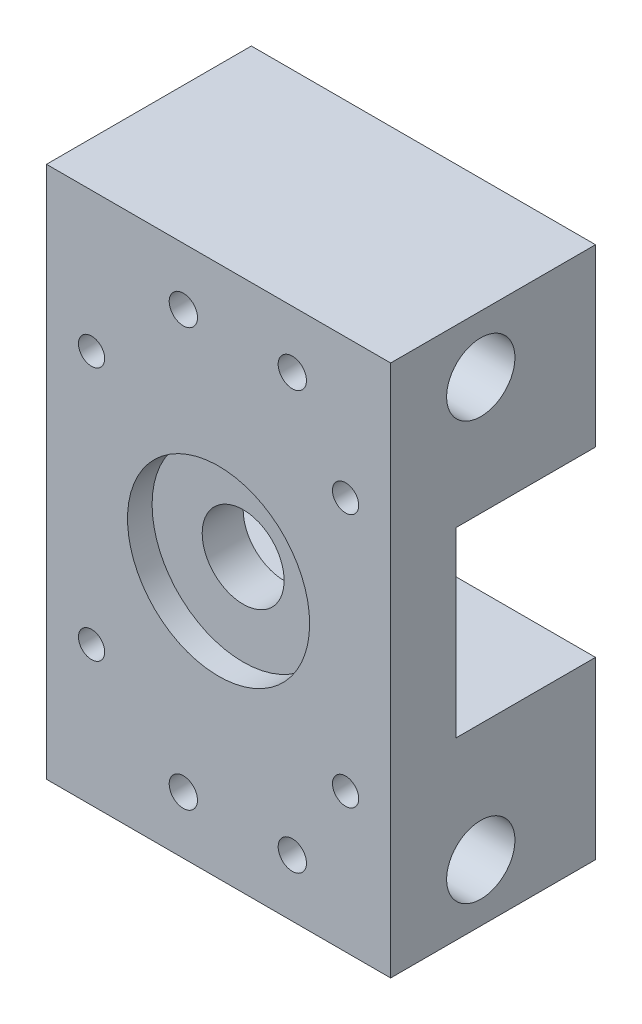
ISO-10303-21;
HEADER;
FILE_DESCRIPTION(('STEP AP214'),'2;1');
FILE_NAME('part.step','',(''),(''),'','','');
FILE_SCHEMA(('AUTOMOTIVE_DESIGN { 1 0 10303 214 1 1 1 1 }'));
ENDSEC;
DATA;
#1=APPLICATION_CONTEXT('core data for automotive mechanical design processes');
#2=APPLICATION_PROTOCOL_DEFINITION('international standard','automotive_design',2000,#1);
#3=PRODUCT_CONTEXT('',#1,'mechanical');
#4=PRODUCT('Part','Part','',(#3));
#5=PRODUCT_RELATED_PRODUCT_CATEGORY('part','',(#4));
#6=PRODUCT_DEFINITION_FORMATION('','',#4);
#7=PRODUCT_DEFINITION_CONTEXT('part definition',#1,'design');
#8=PRODUCT_DEFINITION('design','',#6,#7);
#9=PRODUCT_DEFINITION_SHAPE('','',#8);
#10=(LENGTH_UNIT() NAMED_UNIT(*) SI_UNIT(.MILLI.,.METRE.));
#11=(NAMED_UNIT(*) PLANE_ANGLE_UNIT() SI_UNIT($,.RADIAN.));
#12=(NAMED_UNIT(*) SI_UNIT($,.STERADIAN.) SOLID_ANGLE_UNIT());
#13=UNCERTAINTY_MEASURE_WITH_UNIT(LENGTH_MEASURE(1.E-05),#10,'distance_accuracy_value','');
#14=(GEOMETRIC_REPRESENTATION_CONTEXT(3) GLOBAL_UNCERTAINTY_ASSIGNED_CONTEXT((#13)) GLOBAL_UNIT_ASSIGNED_CONTEXT((#10,
#11,#12)) REPRESENTATION_CONTEXT('',''));
#15=CARTESIAN_POINT('',(0.,0.,0.));
#16=DIRECTION('',(0.,0.,1.));
#17=DIRECTION('',(1.,0.,0.));
#18=AXIS2_PLACEMENT_3D('',#15,#16,#17);
#19=CARTESIAN_POINT('',(21.,32.5,21.));
#20=DIRECTION('',(0.,0.,1.));
#21=DIRECTION('',(1.,0.,0.));
#22=AXIS2_PLACEMENT_3D('',#19,#20,#21);
#23=CYLINDRICAL_SURFACE('',#22,11.1125);
#24=CARTESIAN_POINT('',(21.,32.5,25.));
#25=DIRECTION('',(0.,0.,1.));
#26=DIRECTION('',(1.,0.,0.));
#27=AXIS2_PLACEMENT_3D('',#24,#25,#26);
#28=CIRCLE('',#27,11.1125);
#29=CARTESIAN_POINT('',(32.1125,32.5,25.));
#30=VERTEX_POINT('',#29);
#31=EDGE_CURVE('E128',#30,#30,#28,.T.);
#32=ORIENTED_EDGE('',*,*,#31,.T.);
#33=EDGE_LOOP('',(#32));
#34=FACE_BOUND('',#33,.T.);
#35=CARTESIAN_POINT('',(21.,32.5,22.));
#36=DIRECTION('',(0.,0.,-1.));
#37=DIRECTION('',(-1.,0.,0.));
#38=AXIS2_PLACEMENT_3D('',#35,#36,#37);
#39=CIRCLE('',#38,11.1125);
#40=CARTESIAN_POINT('',(9.88750000000001,32.5,22.));
#41=VERTEX_POINT('',#40);
#42=EDGE_CURVE('E11',#41,#41,#39,.F.);
#43=ORIENTED_EDGE('',*,*,#42,.F.);
#44=EDGE_LOOP('',(#43));
#45=FACE_BOUND('',#44,.T.);
#46=ADVANCED_FACE('F35',(#34,#45),#23,.F.);
#47=CARTESIAN_POINT('',(0.,0.,0.));
#48=DIRECTION('',(0.,0.,1.));
#49=DIRECTION('',(1.,0.,0.));
#50=AXIS2_PLACEMENT_3D('',#47,#48,#49);
#51=PLANE('',#50);
#52=CARTESIAN_POINT('',(36.5,17.,0.));
#53=DIRECTION('',(0.,0.,-1.));
#54=DIRECTION('',(-1.,0.,0.));
#55=AXIS2_PLACEMENT_3D('',#52,#53,#54);
#56=CIRCLE('',#55,3.);
#57=CARTESIAN_POINT('',(33.5,17.,0.));
#58=VERTEX_POINT('',#57);
#59=EDGE_CURVE('E149',#58,#58,#56,.T.);
#60=ORIENTED_EDGE('',*,*,#59,.F.);
#61=EDGE_LOOP('',(#60));
#62=FACE_BOUND('',#61,.T.);
#63=CARTESIAN_POINT('',(30.,7.,0.));
#64=DIRECTION('',(0.,0.,-1.));
#65=DIRECTION('',(-1.,0.,0.));
#66=AXIS2_PLACEMENT_3D('',#63,#64,#65);
#67=CIRCLE('',#66,1.72719999999998);
#68=CARTESIAN_POINT('',(28.2728,7.,0.));
#69=VERTEX_POINT('',#68);
#70=EDGE_CURVE('E185',#69,#69,#67,.T.);
#71=ORIENTED_EDGE('',*,*,#70,.F.);
#72=EDGE_LOOP('',(#71));
#73=FACE_BOUND('',#72,.T.);
#74=CARTESIAN_POINT('',(16.7,7.,0.));
#75=DIRECTION('',(0.,0.,-1.));
#76=DIRECTION('',(-1.,0.,0.));
#77=AXIS2_PLACEMENT_3D('',#74,#75,#76);
#78=CIRCLE('',#77,1.72719999999998);
#79=CARTESIAN_POINT('',(14.9728,7.,0.));
#80=VERTEX_POINT('',#79);
#81=EDGE_CURVE('E188',#80,#80,#78,.T.);
#82=ORIENTED_EDGE('',*,*,#81,.F.);
#83=EDGE_LOOP('',(#82));
#84=FACE_BOUND('',#83,.T.);
#85=DIRECTION('',(0.,-1.,0.));
#86=VECTOR('',#85,1.);
#87=CARTESIAN_POINT('',(0.,65.,0.));
#88=LINE('',#87,#86);
#89=CARTESIAN_POINT('',(0.,21.3875,0.));
#90=VERTEX_POINT('',#89);
#91=CARTESIAN_POINT('',(0.,0.,0.));
#92=VERTEX_POINT('',#91);
#93=EDGE_CURVE('E108',#90,#92,#88,.T.);
#94=ORIENTED_EDGE('',*,*,#93,.F.);
#95=DIRECTION('',(1.,0.,0.));
#96=VECTOR('',#95,1.);
#97=CARTESIAN_POINT('',(0.,21.3875,0.));
#98=LINE('',#97,#96);
#99=CARTESIAN_POINT('',(42.,21.3875,0.));
#100=VERTEX_POINT('',#99);
#101=EDGE_CURVE('E205',#90,#100,#98,.T.);
#102=ORIENTED_EDGE('',*,*,#101,.T.);
#103=DIRECTION('',(0.,1.,0.));
#104=VECTOR('',#103,1.);
#105=CARTESIAN_POINT('',(42.,0.,0.));
#106=LINE('',#105,#104);
#107=CARTESIAN_POINT('',(42.,0.,0.));
#108=VERTEX_POINT('',#107);
#109=EDGE_CURVE('E228',#108,#100,#106,.T.);
#110=ORIENTED_EDGE('',*,*,#109,.F.);
#111=DIRECTION('',(1.,0.,0.));
#112=VECTOR('',#111,1.);
#113=CARTESIAN_POINT('',(0.,0.,0.));
#114=LINE('',#113,#112);
#115=EDGE_CURVE('E226',#92,#108,#114,.T.);
#116=ORIENTED_EDGE('',*,*,#115,.F.);
#117=EDGE_LOOP('',(#94,#102,#110,#116));
#118=FACE_BOUND('',#117,.T.);
#119=CARTESIAN_POINT('',(5.5,17.,0.));
#120=DIRECTION('',(0.,0.,-1.));
#121=DIRECTION('',(-1.,0.,0.));
#122=AXIS2_PLACEMENT_3D('',#119,#120,#121);
#123=CIRCLE('',#122,3.);
#124=CARTESIAN_POINT('',(2.5,17.,0.));
#125=VERTEX_POINT('',#124);
#126=EDGE_CURVE('E158',#125,#125,#123,.T.);
#127=ORIENTED_EDGE('',*,*,#126,.F.);
#128=EDGE_LOOP('',(#127));
#129=FACE_BOUND('',#128,.T.);
#130=ADVANCED_FACE('F248',(#62,#73,#84,#118,#129),#51,.F.);
#131=CARTESIAN_POINT('',(42.,65.,0.));
#132=DIRECTION('',(0.,1.,0.));
#133=DIRECTION('',(0.,0.,1.));
#134=AXIS2_PLACEMENT_3D('',#131,#132,#133);
#135=PLANE('',#134);
#136=DIRECTION('',(0.,0.,1.));
#137=VECTOR('',#136,1.);
#138=CARTESIAN_POINT('',(0.,65.,0.));
#139=LINE('',#138,#137);
#140=CARTESIAN_POINT('',(0.,65.,0.));
#141=VERTEX_POINT('',#140);
#142=CARTESIAN_POINT('',(0.,65.,25.));
#143=VERTEX_POINT('',#142);
#144=EDGE_CURVE('E113',#141,#143,#139,.T.);
#145=ORIENTED_EDGE('',*,*,#144,.T.);
#146=DIRECTION('',(-1.,0.,0.));
#147=VECTOR('',#146,1.);
#148=CARTESIAN_POINT('',(0.,65.,25.));
#149=LINE('',#148,#147);
#150=CARTESIAN_POINT('',(42.,65.,25.));
#151=VERTEX_POINT('',#150);
#152=EDGE_CURVE('E127',#151,#143,#149,.T.);
#153=ORIENTED_EDGE('',*,*,#152,.F.);
#154=DIRECTION('',(0.,0.,1.));
#155=VECTOR('',#154,1.);
#156=CARTESIAN_POINT('',(42.,65.,0.));
#157=LINE('',#156,#155);
#158=CARTESIAN_POINT('',(42.,65.,0.));
#159=VERTEX_POINT('',#158);
#160=EDGE_CURVE('E43',#159,#151,#157,.T.);
#161=ORIENTED_EDGE('',*,*,#160,.F.);
#162=DIRECTION('',(-1.,0.,0.));
#163=VECTOR('',#162,1.);
#164=CARTESIAN_POINT('',(42.,65.,0.));
#165=LINE('',#164,#163);
#166=EDGE_CURVE('E215',#159,#141,#165,.T.);
#167=ORIENTED_EDGE('',*,*,#166,.T.);
#168=EDGE_LOOP('',(#145,#153,#161,#167));
#169=FACE_BOUND('',#168,.T.);
#170=ADVANCED_FACE('F37',(#169),#135,.T.);
#171=CARTESIAN_POINT('',(42.,0.,0.));
#172=DIRECTION('',(1.,0.,0.));
#173=DIRECTION('',(0.,0.,-1.));
#174=AXIS2_PLACEMENT_3D('',#171,#172,#173);
#175=PLANE('',#174);
#176=CARTESIAN_POINT('',(42.,7.,14.));
#177=DIRECTION('',(1.,0.,0.));
#178=DIRECTION('',(0.,0.,-1.));
#179=AXIS2_PLACEMENT_3D('',#176,#177,#178);
#180=CIRCLE('',#179,4.16718750000001);
#181=CARTESIAN_POINT('',(42.,7.,9.83281249999999));
#182=VERTEX_POINT('',#181);
#183=EDGE_CURVE('E137',#182,#182,#180,.T.);
#184=ORIENTED_EDGE('',*,*,#183,.F.);
#185=EDGE_LOOP('',(#184));
#186=FACE_BOUND('',#185,.T.);
#187=CARTESIAN_POINT('',(42.,58.,14.));
#188=DIRECTION('',(1.,0.,0.));
#189=DIRECTION('',(0.,0.,-1.));
#190=AXIS2_PLACEMENT_3D('',#187,#188,#189);
#191=CIRCLE('',#190,4.16718750000002);
#192=CARTESIAN_POINT('',(42.,58.,9.83281249999998));
#193=VERTEX_POINT('',#192);
#194=EDGE_CURVE('E143',#193,#193,#191,.T.);
#195=ORIENTED_EDGE('',*,*,#194,.F.);
#196=EDGE_LOOP('',(#195));
#197=FACE_BOUND('',#196,.T.);
#198=DIRECTION('',(0.,0.,-1.));
#199=VECTOR('',#198,1.);
#200=CARTESIAN_POINT('',(42.,21.3875,17.));
#201=LINE('',#200,#199);
#202=CARTESIAN_POINT('',(42.,21.3875,17.));
#203=VERTEX_POINT('',#202);
#204=EDGE_CURVE('E197',#203,#100,#201,.T.);
#205=ORIENTED_EDGE('',*,*,#204,.F.);
#206=DIRECTION('',(0.,-1.,0.));
#207=VECTOR('',#206,1.);
#208=CARTESIAN_POINT('',(42.,43.6125,17.));
#209=LINE('',#208,#207);
#210=CARTESIAN_POINT('',(42.,43.6125,17.));
#211=VERTEX_POINT('',#210);
#212=EDGE_CURVE('E200',#211,#203,#209,.T.);
#213=ORIENTED_EDGE('',*,*,#212,.F.);
#214=DIRECTION('',(0.,0.,1.));
#215=VECTOR('',#214,1.);
#216=CARTESIAN_POINT('',(42.,43.6125,0.));
#217=LINE('',#216,#215);
#218=CARTESIAN_POINT('',(42.,43.6125,0.));
#219=VERTEX_POINT('',#218);
#220=EDGE_CURVE('E208',#219,#211,#217,.T.);
#221=ORIENTED_EDGE('',*,*,#220,.F.);
#222=EDGE_CURVE('E58',#219,#159,#106,.T.);
#223=ORIENTED_EDGE('',*,*,#222,.T.);
#224=ORIENTED_EDGE('',*,*,#160,.T.);
#225=DIRECTION('',(0.,1.,0.));
#226=VECTOR('',#225,1.);
#227=CARTESIAN_POINT('',(42.,65.,25.));
#228=LINE('',#227,#226);
#229=CARTESIAN_POINT('',(42.,0.,25.));
#230=VERTEX_POINT('',#229);
#231=EDGE_CURVE('E121',#230,#151,#228,.T.);
#232=ORIENTED_EDGE('',*,*,#231,.F.);
#233=DIRECTION('',(0.,0.,1.));
#234=VECTOR('',#233,1.);
#235=CARTESIAN_POINT('',(42.,0.,0.));
#236=LINE('',#235,#234);
#237=EDGE_CURVE('E112',#108,#230,#236,.T.);
#238=ORIENTED_EDGE('',*,*,#237,.F.);
#239=ORIENTED_EDGE('',*,*,#109,.T.);
#240=EDGE_LOOP('',(#205,#213,#221,#223,#224,#232,#238,#239));
#241=FACE_BOUND('',#240,.T.);
#242=ADVANCED_FACE('F240',(#186,#197,#241),#175,.T.);
#243=CARTESIAN_POINT('',(0.,0.,0.));
#244=DIRECTION('',(0.,-1.,0.));
#245=DIRECTION('',(0.,0.,-1.));
#246=AXIS2_PLACEMENT_3D('',#243,#244,#245);
#247=PLANE('',#246);
#248=ORIENTED_EDGE('',*,*,#237,.T.);
#249=DIRECTION('',(1.,0.,0.));
#250=VECTOR('',#249,1.);
#251=CARTESIAN_POINT('',(0.,0.,25.));
#252=LINE('',#251,#250);
#253=CARTESIAN_POINT('',(0.,0.,25.));
#254=VERTEX_POINT('',#253);
#255=EDGE_CURVE('E116',#254,#230,#252,.T.);
#256=ORIENTED_EDGE('',*,*,#255,.F.);
#257=DIRECTION('',(0.,0.,1.));
#258=VECTOR('',#257,1.);
#259=CARTESIAN_POINT('',(0.,0.,0.));
#260=LINE('',#259,#258);
#261=EDGE_CURVE('E101',#92,#254,#260,.T.);
#262=ORIENTED_EDGE('',*,*,#261,.F.);
#263=ORIENTED_EDGE('',*,*,#115,.T.);
#264=EDGE_LOOP('',(#248,#256,#262,#263));
#265=FACE_BOUND('',#264,.T.);
#266=ADVANCED_FACE('F117',(#265),#247,.T.);
#267=CARTESIAN_POINT('',(0.,65.,0.));
#268=DIRECTION('',(-1.,0.,0.));
#269=DIRECTION('',(0.,-1.,0.));
#270=AXIS2_PLACEMENT_3D('',#267,#268,#269);
#271=PLANE('',#270);
#272=DIRECTION('',(0.,0.,-1.));
#273=VECTOR('',#272,1.);
#274=CARTESIAN_POINT('',(0.,21.3875,17.));
#275=LINE('',#274,#273);
#276=CARTESIAN_POINT('',(0.,21.3875,17.));
#277=VERTEX_POINT('',#276);
#278=EDGE_CURVE('E198',#277,#90,#275,.T.);
#279=ORIENTED_EDGE('',*,*,#278,.T.);
#280=ORIENTED_EDGE('',*,*,#93,.T.);
#281=ORIENTED_EDGE('',*,*,#261,.T.);
#282=DIRECTION('',(0.,-1.,0.));
#283=VECTOR('',#282,1.);
#284=CARTESIAN_POINT('',(0.,65.,25.));
#285=LINE('',#284,#283);
#286=EDGE_CURVE('E106',#143,#254,#285,.T.);
#287=ORIENTED_EDGE('',*,*,#286,.F.);
#288=ORIENTED_EDGE('',*,*,#144,.F.);
#289=CARTESIAN_POINT('',(0.,43.6125,0.));
#290=VERTEX_POINT('',#289);
#291=EDGE_CURVE('E223',#141,#290,#88,.T.);
#292=ORIENTED_EDGE('',*,*,#291,.T.);
#293=DIRECTION('',(0.,0.,1.));
#294=VECTOR('',#293,1.);
#295=CARTESIAN_POINT('',(0.,43.6125,0.));
#296=LINE('',#295,#294);
#297=CARTESIAN_POINT('',(0.,43.6125,17.));
#298=VERTEX_POINT('',#297);
#299=EDGE_CURVE('E50',#290,#298,#296,.T.);
#300=ORIENTED_EDGE('',*,*,#299,.T.);
#301=DIRECTION('',(0.,-1.,0.));
#302=VECTOR('',#301,1.);
#303=CARTESIAN_POINT('',(0.,43.6125,17.));
#304=LINE('',#303,#302);
#305=EDGE_CURVE('E202',#298,#277,#304,.T.);
#306=ORIENTED_EDGE('',*,*,#305,.T.);
#307=EDGE_LOOP('',(#279,#280,#281,#287,#288,#292,#300,#306));
#308=FACE_BOUND('',#307,.T.);
#309=ADVANCED_FACE('F104',(#308),#271,.T.);
#310=CARTESIAN_POINT('',(5.5,48.,0.));
#311=DIRECTION('',(0.,0.,-1.));
#312=DIRECTION('',(-1.,0.,0.));
#313=AXIS2_PLACEMENT_3D('',#310,#311,#312);
#314=CIRCLE('',#313,3.);
#315=CARTESIAN_POINT('',(2.5,48.,0.));
#316=VERTEX_POINT('',#315);
#317=EDGE_CURVE('E167',#316,#316,#314,.T.);
#318=ORIENTED_EDGE('',*,*,#317,.F.);
#319=EDGE_LOOP('',(#318));
#320=FACE_BOUND('',#319,.T.);
#321=CARTESIAN_POINT('',(36.5,48.,0.));
#322=DIRECTION('',(0.,0.,-1.));
#323=DIRECTION('',(-1.,0.,0.));
#324=AXIS2_PLACEMENT_3D('',#321,#322,#323);
#325=CIRCLE('',#324,3.);
#326=CARTESIAN_POINT('',(33.5,48.,0.));
#327=VERTEX_POINT('',#326);
#328=EDGE_CURVE('E176',#327,#327,#325,.T.);
#329=ORIENTED_EDGE('',*,*,#328,.F.);
#330=EDGE_LOOP('',(#329));
#331=FACE_BOUND('',#330,.T.);
#332=CARTESIAN_POINT('',(16.7,58.,0.));
#333=DIRECTION('',(0.,0.,-1.));
#334=DIRECTION('',(-1.,0.,0.));
#335=AXIS2_PLACEMENT_3D('',#332,#333,#334);
#336=CIRCLE('',#335,1.72719999999998);
#337=CARTESIAN_POINT('',(14.9728,58.,0.));
#338=VERTEX_POINT('',#337);
#339=EDGE_CURVE('E191',#338,#338,#336,.T.);
#340=ORIENTED_EDGE('',*,*,#339,.F.);
#341=EDGE_LOOP('',(#340));
#342=FACE_BOUND('',#341,.T.);
#343=CARTESIAN_POINT('',(30.,58.,0.));
#344=DIRECTION('',(0.,0.,-1.));
#345=DIRECTION('',(-1.,0.,0.));
#346=AXIS2_PLACEMENT_3D('',#343,#344,#345);
#347=CIRCLE('',#346,1.72719999999998);
#348=CARTESIAN_POINT('',(28.2728,58.,0.));
#349=VERTEX_POINT('',#348);
#350=EDGE_CURVE('E194',#349,#349,#347,.T.);
#351=ORIENTED_EDGE('',*,*,#350,.F.);
#352=EDGE_LOOP('',(#351));
#353=FACE_BOUND('',#352,.T.);
#354=ORIENTED_EDGE('',*,*,#222,.F.);
#355=DIRECTION('',(1.,0.,0.));
#356=VECTOR('',#355,1.);
#357=CARTESIAN_POINT('',(0.,43.6125,0.));
#358=LINE('',#357,#356);
#359=EDGE_CURVE('E218',#290,#219,#358,.T.);
#360=ORIENTED_EDGE('',*,*,#359,.F.);
#361=ORIENTED_EDGE('',*,*,#291,.F.);
#362=ORIENTED_EDGE('',*,*,#166,.F.);
#363=EDGE_LOOP('',(#354,#360,#361,#362));
#364=FACE_BOUND('',#363,.T.);
#365=ADVANCED_FACE('F236',(#320,#331,#342,#353,#364),#51,.F.);
#366=CARTESIAN_POINT('',(0.,21.3875,17.));
#367=DIRECTION('',(0.,-1.,0.));
#368=DIRECTION('',(0.,0.,-1.));
#369=AXIS2_PLACEMENT_3D('',#366,#367,#368);
#370=PLANE('',#369);
#371=ORIENTED_EDGE('',*,*,#204,.T.);
#372=ORIENTED_EDGE('',*,*,#101,.F.);
#373=ORIENTED_EDGE('',*,*,#278,.F.);
#374=DIRECTION('',(1.,0.,0.));
#375=VECTOR('',#374,1.);
#376=CARTESIAN_POINT('',(0.,21.3875,17.));
#377=LINE('',#376,#375);
#378=EDGE_CURVE('E213',#277,#203,#377,.T.);
#379=ORIENTED_EDGE('',*,*,#378,.T.);
#380=EDGE_LOOP('',(#371,#372,#373,#379));
#381=FACE_BOUND('',#380,.T.);
#382=ADVANCED_FACE('F251',(#381),#370,.F.);
#383=CARTESIAN_POINT('',(0.,43.6125,17.));
#384=DIRECTION('',(0.,0.,1.));
#385=DIRECTION('',(1.,0.,0.));
#386=AXIS2_PLACEMENT_3D('',#383,#384,#385);
#387=PLANE('',#386);
#388=ORIENTED_EDGE('',*,*,#212,.T.);
#389=ORIENTED_EDGE('',*,*,#378,.F.);
#390=ORIENTED_EDGE('',*,*,#305,.F.);
#391=DIRECTION('',(1.,0.,0.));
#392=VECTOR('',#391,1.);
#393=CARTESIAN_POINT('',(0.,43.6125,17.));
#394=LINE('',#393,#392);
#395=EDGE_CURVE('E216',#298,#211,#394,.T.);
#396=ORIENTED_EDGE('',*,*,#395,.T.);
#397=EDGE_LOOP('',(#388,#389,#390,#396));
#398=FACE_BOUND('',#397,.T.);
#399=CARTESIAN_POINT('',(21.,32.5,17.));
#400=DIRECTION('',(0.,0.,-1.));
#401=DIRECTION('',(-1.,0.,0.));
#402=AXIS2_PLACEMENT_3D('',#399,#400,#401);
#403=CIRCLE('',#402,5.);
#404=CARTESIAN_POINT('',(16.,32.5,17.));
#405=VERTEX_POINT('',#404);
#406=EDGE_CURVE('E616',#405,#405,#403,.T.);
#407=ORIENTED_EDGE('',*,*,#406,.F.);
#408=EDGE_LOOP('',(#407));
#409=FACE_BOUND('',#408,.T.);
#410=ADVANCED_FACE('F242',(#398,#409),#387,.F.);
#411=CARTESIAN_POINT('',(0.,43.6125,0.));
#412=DIRECTION('',(0.,1.,0.));
#413=DIRECTION('',(0.,0.,1.));
#414=AXIS2_PLACEMENT_3D('',#411,#412,#413);
#415=PLANE('',#414);
#416=ORIENTED_EDGE('',*,*,#359,.T.);
#417=ORIENTED_EDGE('',*,*,#220,.T.);
#418=ORIENTED_EDGE('',*,*,#395,.F.);
#419=ORIENTED_EDGE('',*,*,#299,.F.);
#420=EDGE_LOOP('',(#416,#417,#418,#419));
#421=FACE_BOUND('',#420,.T.);
#422=ADVANCED_FACE('F237',(#421),#415,.F.);
#423=CARTESIAN_POINT('',(30.,58.,0.));
#424=DIRECTION('',(0.,0.,-1.));
#425=DIRECTION('',(-1.,0.,0.));
#426=AXIS2_PLACEMENT_3D('',#423,#424,#425);
#427=CYLINDRICAL_SURFACE('',#426,1.72719999999998);
#428=ORIENTED_EDGE('',*,*,#350,.T.);
#429=EDGE_LOOP('',(#428));
#430=FACE_BOUND('',#429,.T.);
#431=CARTESIAN_POINT('',(30.,58.,25.));
#432=DIRECTION('',(0.,0.,1.));
#433=DIRECTION('',(1.,0.,0.));
#434=AXIS2_PLACEMENT_3D('',#431,#432,#433);
#435=CIRCLE('',#434,1.72719999999999);
#436=CARTESIAN_POINT('',(31.7272,58.,25.));
#437=VERTEX_POINT('',#436);
#438=EDGE_CURVE('E623',#437,#437,#435,.T.);
#439=ORIENTED_EDGE('',*,*,#438,.T.);
#440=EDGE_LOOP('',(#439));
#441=FACE_BOUND('',#440,.T.);
#442=ADVANCED_FACE('F285',(#430,#441),#427,.F.);
#443=CARTESIAN_POINT('',(16.7,58.,0.));
#444=DIRECTION('',(0.,0.,-1.));
#445=DIRECTION('',(-1.,0.,0.));
#446=AXIS2_PLACEMENT_3D('',#443,#444,#445);
#447=CYLINDRICAL_SURFACE('',#446,1.72719999999998);
#448=ORIENTED_EDGE('',*,*,#339,.T.);
#449=EDGE_LOOP('',(#448));
#450=FACE_BOUND('',#449,.T.);
#451=CARTESIAN_POINT('',(16.7,58.,25.));
#452=DIRECTION('',(0.,0.,1.));
#453=DIRECTION('',(1.,0.,0.));
#454=AXIS2_PLACEMENT_3D('',#451,#452,#453);
#455=CIRCLE('',#454,1.72719999999998);
#456=CARTESIAN_POINT('',(18.4272,58.,25.));
#457=VERTEX_POINT('',#456);
#458=EDGE_CURVE('E629',#457,#457,#455,.T.);
#459=ORIENTED_EDGE('',*,*,#458,.T.);
#460=EDGE_LOOP('',(#459));
#461=FACE_BOUND('',#460,.T.);
#462=ADVANCED_FACE('F281',(#450,#461),#447,.F.);
#463=CARTESIAN_POINT('',(16.7,7.,0.));
#464=DIRECTION('',(0.,0.,-1.));
#465=DIRECTION('',(-1.,0.,0.));
#466=AXIS2_PLACEMENT_3D('',#463,#464,#465);
#467=CYLINDRICAL_SURFACE('',#466,1.72719999999998);
#468=ORIENTED_EDGE('',*,*,#81,.T.);
#469=EDGE_LOOP('',(#468));
#470=FACE_BOUND('',#469,.T.);
#471=CARTESIAN_POINT('',(16.7,7.,25.));
#472=DIRECTION('',(0.,0.,1.));
#473=DIRECTION('',(1.,0.,0.));
#474=AXIS2_PLACEMENT_3D('',#471,#472,#473);
#475=CIRCLE('',#474,1.72719999999998);
#476=CARTESIAN_POINT('',(18.4272,7.,25.));
#477=VERTEX_POINT('',#476);
#478=EDGE_CURVE('E131',#477,#477,#475,.T.);
#479=ORIENTED_EDGE('',*,*,#478,.T.);
#480=EDGE_LOOP('',(#479));
#481=FACE_BOUND('',#480,.T.);
#482=ADVANCED_FACE('F277',(#470,#481),#467,.F.);
#483=CARTESIAN_POINT('',(30.,7.,0.));
#484=DIRECTION('',(0.,0.,-1.));
#485=DIRECTION('',(-1.,0.,0.));
#486=AXIS2_PLACEMENT_3D('',#483,#484,#485);
#487=CYLINDRICAL_SURFACE('',#486,1.72719999999998);
#488=ORIENTED_EDGE('',*,*,#70,.T.);
#489=EDGE_LOOP('',(#488));
#490=FACE_BOUND('',#489,.T.);
#491=CARTESIAN_POINT('',(30.,7.,25.));
#492=DIRECTION('',(0.,0.,1.));
#493=DIRECTION('',(1.,0.,0.));
#494=AXIS2_PLACEMENT_3D('',#491,#492,#493);
#495=CIRCLE('',#494,1.72719999999999);
#496=CARTESIAN_POINT('',(31.7272,7.,25.));
#497=VERTEX_POINT('',#496);
#498=EDGE_CURVE('E638',#497,#497,#495,.T.);
#499=ORIENTED_EDGE('',*,*,#498,.T.);
#500=EDGE_LOOP('',(#499));
#501=FACE_BOUND('',#500,.T.);
#502=ADVANCED_FACE('F274',(#490,#501),#487,.F.);
#503=CARTESIAN_POINT('',(36.5,48.,0.));
#504=DIRECTION('',(0.,0.,-1.));
#505=DIRECTION('',(-1.,0.,0.));
#506=AXIS2_PLACEMENT_3D('',#503,#504,#505);
#507=CYLINDRICAL_SURFACE('',#506,1.60000000000001);
#508=CARTESIAN_POINT('',(36.5,48.,7.62));
#509=DIRECTION('',(0.,0.,-1.));
#510=DIRECTION('',(-1.,0.,0.));
#511=AXIS2_PLACEMENT_3D('',#508,#509,#510);
#512=CIRCLE('',#511,1.60000000000001);
#513=CARTESIAN_POINT('',(34.9,48.,7.62));
#514=VERTEX_POINT('',#513);
#515=EDGE_CURVE('E182',#514,#514,#512,.T.);
#516=ORIENTED_EDGE('',*,*,#515,.T.);
#517=EDGE_LOOP('',(#516));
#518=FACE_BOUND('',#517,.T.);
#519=CARTESIAN_POINT('',(36.5,48.,25.));
#520=DIRECTION('',(0.,0.,1.));
#521=DIRECTION('',(1.,0.,0.));
#522=AXIS2_PLACEMENT_3D('',#519,#520,#521);
#523=CIRCLE('',#522,1.60000000000001);
#524=CARTESIAN_POINT('',(38.1,48.,25.));
#525=VERTEX_POINT('',#524);
#526=EDGE_CURVE('E626',#525,#525,#523,.T.);
#527=ORIENTED_EDGE('',*,*,#526,.T.);
#528=EDGE_LOOP('',(#527));
#529=FACE_BOUND('',#528,.T.);
#530=ADVANCED_FACE('F272',(#518,#529),#507,.F.);
#531=CARTESIAN_POINT('',(38.1,48.,7.62));
#532=DIRECTION('',(0.,0.,1.));
#533=DIRECTION('',(1.,0.,0.));
#534=AXIS2_PLACEMENT_3D('',#531,#532,#533);
#535=PLANE('',#534);
#536=ORIENTED_EDGE('',*,*,#515,.F.);
#537=EDGE_LOOP('',(#536));
#538=FACE_BOUND('',#537,.T.);
#539=CARTESIAN_POINT('',(36.5,48.,7.62));
#540=DIRECTION('',(0.,0.,-1.));
#541=DIRECTION('',(-1.,0.,0.));
#542=AXIS2_PLACEMENT_3D('',#539,#540,#541);
#543=CIRCLE('',#542,3.);
#544=CARTESIAN_POINT('',(33.5,48.,7.62));
#545=VERTEX_POINT('',#544);
#546=EDGE_CURVE('E179',#545,#545,#543,.T.);
#547=ORIENTED_EDGE('',*,*,#546,.T.);
#548=EDGE_LOOP('',(#547));
#549=FACE_BOUND('',#548,.T.);
#550=ADVANCED_FACE('F318',(#538,#549),#535,.F.);
#551=CARTESIAN_POINT('',(36.5,48.,0.));
#552=DIRECTION('',(0.,0.,-1.));
#553=DIRECTION('',(-1.,0.,0.));
#554=AXIS2_PLACEMENT_3D('',#551,#552,#553);
#555=CYLINDRICAL_SURFACE('',#554,3.);
#556=ORIENTED_EDGE('',*,*,#546,.F.);
#557=EDGE_LOOP('',(#556));
#558=FACE_BOUND('',#557,.T.);
#559=ORIENTED_EDGE('',*,*,#328,.T.);
#560=EDGE_LOOP('',(#559));
#561=FACE_BOUND('',#560,.T.);
#562=ADVANCED_FACE('F326',(#558,#561),#555,.F.);
#563=CARTESIAN_POINT('',(5.5,48.,0.));
#564=DIRECTION('',(0.,0.,-1.));
#565=DIRECTION('',(-1.,0.,0.));
#566=AXIS2_PLACEMENT_3D('',#563,#564,#565);
#567=CYLINDRICAL_SURFACE('',#566,1.6);
#568=CARTESIAN_POINT('',(5.5,48.,7.62));
#569=DIRECTION('',(0.,0.,-1.));
#570=DIRECTION('',(-1.,0.,0.));
#571=AXIS2_PLACEMENT_3D('',#568,#569,#570);
#572=CIRCLE('',#571,1.60000000000001);
#573=CARTESIAN_POINT('',(3.89999999999999,48.,7.62));
#574=VERTEX_POINT('',#573);
#575=EDGE_CURVE('E173',#574,#574,#572,.T.);
#576=ORIENTED_EDGE('',*,*,#575,.T.);
#577=EDGE_LOOP('',(#576));
#578=FACE_BOUND('',#577,.T.);
#579=CARTESIAN_POINT('',(5.5,48.,25.));
#580=DIRECTION('',(0.,0.,1.));
#581=DIRECTION('',(1.,0.,0.));
#582=AXIS2_PLACEMENT_3D('',#579,#580,#581);
#583=CIRCLE('',#582,1.6);
#584=CARTESIAN_POINT('',(7.1,48.,25.));
#585=VERTEX_POINT('',#584);
#586=EDGE_CURVE('E632',#585,#585,#583,.T.);
#587=ORIENTED_EDGE('',*,*,#586,.T.);
#588=EDGE_LOOP('',(#587));
#589=FACE_BOUND('',#588,.T.);
#590=ADVANCED_FACE('F334',(#578,#589),#567,.F.);
#591=CARTESIAN_POINT('',(7.10000000000001,48.,7.62));
#592=DIRECTION('',(0.,0.,1.));
#593=DIRECTION('',(1.,0.,0.));
#594=AXIS2_PLACEMENT_3D('',#591,#592,#593);
#595=PLANE('',#594);
#596=ORIENTED_EDGE('',*,*,#575,.F.);
#597=EDGE_LOOP('',(#596));
#598=FACE_BOUND('',#597,.T.);
#599=CARTESIAN_POINT('',(5.5,48.,7.62));
#600=DIRECTION('',(0.,0.,-1.));
#601=DIRECTION('',(-1.,0.,0.));
#602=AXIS2_PLACEMENT_3D('',#599,#600,#601);
#603=CIRCLE('',#602,3.);
#604=CARTESIAN_POINT('',(2.5,48.,7.62));
#605=VERTEX_POINT('',#604);
#606=EDGE_CURVE('E170',#605,#605,#603,.T.);
#607=ORIENTED_EDGE('',*,*,#606,.T.);
#608=EDGE_LOOP('',(#607));
#609=FACE_BOUND('',#608,.T.);
#610=ADVANCED_FACE('F342',(#598,#609),#595,.F.);
#611=CARTESIAN_POINT('',(5.5,48.,0.));
#612=DIRECTION('',(0.,0.,-1.));
#613=DIRECTION('',(-1.,0.,0.));
#614=AXIS2_PLACEMENT_3D('',#611,#612,#613);
#615=CYLINDRICAL_SURFACE('',#614,3.);
#616=ORIENTED_EDGE('',*,*,#606,.F.);
#617=EDGE_LOOP('',(#616));
#618=FACE_BOUND('',#617,.T.);
#619=ORIENTED_EDGE('',*,*,#317,.T.);
#620=EDGE_LOOP('',(#619));
#621=FACE_BOUND('',#620,.T.);
#622=ADVANCED_FACE('F350',(#618,#621),#615,.F.);
#623=CARTESIAN_POINT('',(5.5,17.,0.));
#624=DIRECTION('',(0.,0.,-1.));
#625=DIRECTION('',(-1.,0.,0.));
#626=AXIS2_PLACEMENT_3D('',#623,#624,#625);
#627=CYLINDRICAL_SURFACE('',#626,1.6);
#628=CARTESIAN_POINT('',(5.5,17.,7.62));
#629=DIRECTION('',(0.,0.,-1.));
#630=DIRECTION('',(-1.,0.,0.));
#631=AXIS2_PLACEMENT_3D('',#628,#629,#630);
#632=CIRCLE('',#631,1.60000000000001);
#633=CARTESIAN_POINT('',(3.89999999999999,17.,7.62));
#634=VERTEX_POINT('',#633);
#635=EDGE_CURVE('E164',#634,#634,#632,.T.);
#636=ORIENTED_EDGE('',*,*,#635,.T.);
#637=EDGE_LOOP('',(#636));
#638=FACE_BOUND('',#637,.T.);
#639=CARTESIAN_POINT('',(5.5,17.,25.));
#640=DIRECTION('',(0.,0.,1.));
#641=DIRECTION('',(1.,0.,0.));
#642=AXIS2_PLACEMENT_3D('',#639,#640,#641);
#643=CIRCLE('',#642,1.6);
#644=CARTESIAN_POINT('',(7.1,17.,25.));
#645=VERTEX_POINT('',#644);
#646=EDGE_CURVE('E635',#645,#645,#643,.T.);
#647=ORIENTED_EDGE('',*,*,#646,.T.);
#648=EDGE_LOOP('',(#647));
#649=FACE_BOUND('',#648,.T.);
#650=ADVANCED_FACE('F358',(#638,#649),#627,.F.);
#651=CARTESIAN_POINT('',(7.10000000000001,17.,7.62));
#652=DIRECTION('',(0.,0.,1.));
#653=DIRECTION('',(1.,0.,0.));
#654=AXIS2_PLACEMENT_3D('',#651,#652,#653);
#655=PLANE('',#654);
#656=ORIENTED_EDGE('',*,*,#635,.F.);
#657=EDGE_LOOP('',(#656));
#658=FACE_BOUND('',#657,.T.);
#659=CARTESIAN_POINT('',(5.5,17.,7.62));
#660=DIRECTION('',(0.,0.,-1.));
#661=DIRECTION('',(-1.,0.,0.));
#662=AXIS2_PLACEMENT_3D('',#659,#660,#661);
#663=CIRCLE('',#662,3.);
#664=CARTESIAN_POINT('',(2.5,17.,7.62));
#665=VERTEX_POINT('',#664);
#666=EDGE_CURVE('E161',#665,#665,#663,.T.);
#667=ORIENTED_EDGE('',*,*,#666,.T.);
#668=EDGE_LOOP('',(#667));
#669=FACE_BOUND('',#668,.T.);
#670=ADVANCED_FACE('F366',(#658,#669),#655,.F.);
#671=CARTESIAN_POINT('',(5.5,17.,0.));
#672=DIRECTION('',(0.,0.,-1.));
#673=DIRECTION('',(-1.,0.,0.));
#674=AXIS2_PLACEMENT_3D('',#671,#672,#673);
#675=CYLINDRICAL_SURFACE('',#674,3.);
#676=ORIENTED_EDGE('',*,*,#666,.F.);
#677=EDGE_LOOP('',(#676));
#678=FACE_BOUND('',#677,.T.);
#679=ORIENTED_EDGE('',*,*,#126,.T.);
#680=EDGE_LOOP('',(#679));
#681=FACE_BOUND('',#680,.T.);
#682=ADVANCED_FACE('F374',(#678,#681),#675,.F.);
#683=CARTESIAN_POINT('',(36.5,17.,0.));
#684=DIRECTION('',(0.,0.,-1.));
#685=DIRECTION('',(-1.,0.,0.));
#686=AXIS2_PLACEMENT_3D('',#683,#684,#685);
#687=CYLINDRICAL_SURFACE('',#686,1.60000000000001);
#688=CARTESIAN_POINT('',(36.5,17.,7.62));
#689=DIRECTION('',(0.,0.,-1.));
#690=DIRECTION('',(-1.,0.,0.));
#691=AXIS2_PLACEMENT_3D('',#688,#689,#690);
#692=CIRCLE('',#691,1.60000000000001);
#693=CARTESIAN_POINT('',(34.9,17.,7.62));
#694=VERTEX_POINT('',#693);
#695=EDGE_CURVE('E155',#694,#694,#692,.T.);
#696=ORIENTED_EDGE('',*,*,#695,.T.);
#697=EDGE_LOOP('',(#696));
#698=FACE_BOUND('',#697,.T.);
#699=CARTESIAN_POINT('',(36.5,17.,25.));
#700=DIRECTION('',(0.,0.,1.));
#701=DIRECTION('',(1.,0.,0.));
#702=AXIS2_PLACEMENT_3D('',#699,#700,#701);
#703=CIRCLE('',#702,1.6);
#704=CARTESIAN_POINT('',(38.1,17.,25.));
#705=VERTEX_POINT('',#704);
#706=EDGE_CURVE('E618',#705,#705,#703,.T.);
#707=ORIENTED_EDGE('',*,*,#706,.T.);
#708=EDGE_LOOP('',(#707));
#709=FACE_BOUND('',#708,.T.);
#710=ADVANCED_FACE('F382',(#698,#709),#687,.F.);
#711=CARTESIAN_POINT('',(38.1,17.,7.62));
#712=DIRECTION('',(0.,0.,1.));
#713=DIRECTION('',(1.,0.,0.));
#714=AXIS2_PLACEMENT_3D('',#711,#712,#713);
#715=PLANE('',#714);
#716=ORIENTED_EDGE('',*,*,#695,.F.);
#717=EDGE_LOOP('',(#716));
#718=FACE_BOUND('',#717,.T.);
#719=CARTESIAN_POINT('',(36.5,17.,7.62));
#720=DIRECTION('',(0.,0.,-1.));
#721=DIRECTION('',(-1.,0.,0.));
#722=AXIS2_PLACEMENT_3D('',#719,#720,#721);
#723=CIRCLE('',#722,3.);
#724=CARTESIAN_POINT('',(33.5,17.,7.62));
#725=VERTEX_POINT('',#724);
#726=EDGE_CURVE('E152',#725,#725,#723,.T.);
#727=ORIENTED_EDGE('',*,*,#726,.T.);
#728=EDGE_LOOP('',(#727));
#729=FACE_BOUND('',#728,.T.);
#730=ADVANCED_FACE('F390',(#718,#729),#715,.F.);
#731=CARTESIAN_POINT('',(36.5,17.,0.));
#732=DIRECTION('',(0.,0.,-1.));
#733=DIRECTION('',(-1.,0.,0.));
#734=AXIS2_PLACEMENT_3D('',#731,#732,#733);
#735=CYLINDRICAL_SURFACE('',#734,3.);
#736=ORIENTED_EDGE('',*,*,#726,.F.);
#737=EDGE_LOOP('',(#736));
#738=FACE_BOUND('',#737,.T.);
#739=ORIENTED_EDGE('',*,*,#59,.T.);
#740=EDGE_LOOP('',(#739));
#741=FACE_BOUND('',#740,.T.);
#742=ADVANCED_FACE('F398',(#738,#741),#735,.F.);
#743=CARTESIAN_POINT('',(34.,58.,14.));
#744=DIRECTION('',(-1.,0.,0.));
#745=DIRECTION('',(0.,0.,1.));
#746=AXIS2_PLACEMENT_3D('',#743,#744,#745);
#747=PLANE('',#746);
#748=CARTESIAN_POINT('',(34.,58.,14.));
#749=DIRECTION('',(1.,0.,0.));
#750=DIRECTION('',(0.,0.,-1.));
#751=AXIS2_PLACEMENT_3D('',#748,#749,#750);
#752=CIRCLE('',#751,4.16718750000002);
#753=CARTESIAN_POINT('',(34.,58.,9.83281249999998));
#754=VERTEX_POINT('',#753);
#755=EDGE_CURVE('E146',#754,#754,#752,.T.);
#756=ORIENTED_EDGE('',*,*,#755,.T.);
#757=EDGE_LOOP('',(#756));
#758=FACE_BOUND('',#757,.T.);
#759=ADVANCED_FACE('F406',(#758),#747,.F.);
#760=CARTESIAN_POINT('',(42.,58.,14.));
#761=DIRECTION('',(1.,0.,0.));
#762=DIRECTION('',(0.,0.,-1.));
#763=AXIS2_PLACEMENT_3D('',#760,#761,#762);
#764=CYLINDRICAL_SURFACE('',#763,4.16718750000002);
#765=ORIENTED_EDGE('',*,*,#755,.F.);
#766=EDGE_LOOP('',(#765));
#767=FACE_BOUND('',#766,.T.);
#768=ORIENTED_EDGE('',*,*,#194,.T.);
#769=EDGE_LOOP('',(#768));
#770=FACE_BOUND('',#769,.T.);
#771=ADVANCED_FACE('F414',(#767,#770),#764,.F.);
#772=CARTESIAN_POINT('',(34.,7.,14.));
#773=DIRECTION('',(-1.,0.,0.));
#774=DIRECTION('',(0.,0.,1.));
#775=AXIS2_PLACEMENT_3D('',#772,#773,#774);
#776=PLANE('',#775);
#777=CARTESIAN_POINT('',(34.,7.,14.));
#778=DIRECTION('',(1.,0.,0.));
#779=DIRECTION('',(0.,0.,-1.));
#780=AXIS2_PLACEMENT_3D('',#777,#778,#779);
#781=CIRCLE('',#780,4.16718750000001);
#782=CARTESIAN_POINT('',(34.,7.,9.83281249999999));
#783=VERTEX_POINT('',#782);
#784=EDGE_CURVE('E140',#783,#783,#781,.T.);
#785=ORIENTED_EDGE('',*,*,#784,.T.);
#786=EDGE_LOOP('',(#785));
#787=FACE_BOUND('',#786,.T.);
#788=ADVANCED_FACE('F422',(#787),#776,.F.);
#789=CARTESIAN_POINT('',(42.,7.,14.));
#790=DIRECTION('',(1.,0.,0.));
#791=DIRECTION('',(0.,0.,-1.));
#792=AXIS2_PLACEMENT_3D('',#789,#790,#791);
#793=CYLINDRICAL_SURFACE('',#792,4.16718750000001);
#794=ORIENTED_EDGE('',*,*,#784,.F.);
#795=EDGE_LOOP('',(#794));
#796=FACE_BOUND('',#795,.T.);
#797=ORIENTED_EDGE('',*,*,#183,.T.);
#798=EDGE_LOOP('',(#797));
#799=FACE_BOUND('',#798,.T.);
#800=ADVANCED_FACE('F430',(#796,#799),#793,.F.);
#801=CARTESIAN_POINT('',(0.,0.,25.));
#802=DIRECTION('',(0.,0.,1.));
#803=DIRECTION('',(1.,0.,0.));
#804=AXIS2_PLACEMENT_3D('',#801,#802,#803);
#805=PLANE('',#804);
#806=ORIENTED_EDGE('',*,*,#438,.F.);
#807=EDGE_LOOP('',(#806));
#808=FACE_BOUND('',#807,.T.);
#809=ORIENTED_EDGE('',*,*,#458,.F.);
#810=EDGE_LOOP('',(#809));
#811=FACE_BOUND('',#810,.T.);
#812=ORIENTED_EDGE('',*,*,#646,.F.);
#813=EDGE_LOOP('',(#812));
#814=FACE_BOUND('',#813,.T.);
#815=ORIENTED_EDGE('',*,*,#478,.F.);
#816=EDGE_LOOP('',(#815));
#817=FACE_BOUND('',#816,.T.);
#818=ORIENTED_EDGE('',*,*,#286,.T.);
#819=ORIENTED_EDGE('',*,*,#255,.T.);
#820=ORIENTED_EDGE('',*,*,#231,.T.);
#821=ORIENTED_EDGE('',*,*,#152,.T.);
#822=EDGE_LOOP('',(#818,#819,#820,#821));
#823=FACE_BOUND('',#822,.T.);
#824=ORIENTED_EDGE('',*,*,#31,.F.);
#825=EDGE_LOOP('',(#824));
#826=FACE_BOUND('',#825,.T.);
#827=ORIENTED_EDGE('',*,*,#498,.F.);
#828=EDGE_LOOP('',(#827));
#829=FACE_BOUND('',#828,.T.);
#830=ORIENTED_EDGE('',*,*,#586,.F.);
#831=EDGE_LOOP('',(#830));
#832=FACE_BOUND('',#831,.T.);
#833=ORIENTED_EDGE('',*,*,#526,.F.);
#834=EDGE_LOOP('',(#833));
#835=FACE_BOUND('',#834,.T.);
#836=ORIENTED_EDGE('',*,*,#706,.F.);
#837=EDGE_LOOP('',(#836));
#838=FACE_BOUND('',#837,.T.);
#839=ADVANCED_FACE('F124',(#808,#811,#814,#817,#823,#826,#829,#832,#835,#838),#805,.T.);
#840=CARTESIAN_POINT('',(21.,32.5,22.));
#841=DIRECTION('',(0.,0.,-1.));
#842=DIRECTION('',(-1.,0.,0.));
#843=AXIS2_PLACEMENT_3D('',#840,#841,#842);
#844=PLANE('',#843);
#845=CARTESIAN_POINT('',(21.,32.5,22.));
#846=DIRECTION('',(0.,0.,-1.));
#847=DIRECTION('',(-1.,0.,0.));
#848=AXIS2_PLACEMENT_3D('',#845,#846,#847);
#849=CIRCLE('',#848,5.);
#850=CARTESIAN_POINT('',(16.,32.5,22.));
#851=VERTEX_POINT('',#850);
#852=EDGE_CURVE('E613',#851,#851,#849,.T.);
#853=ORIENTED_EDGE('',*,*,#852,.T.);
#854=EDGE_LOOP('',(#853));
#855=FACE_BOUND('',#854,.T.);
#856=ORIENTED_EDGE('',*,*,#42,.T.);
#857=EDGE_LOOP('',(#856));
#858=FACE_BOUND('',#857,.T.);
#859=ADVANCED_FACE('F445',(#855,#858),#844,.F.);
#860=CARTESIAN_POINT('',(21.,32.5,22.));
#861=DIRECTION('',(0.,0.,-1.));
#862=DIRECTION('',(-1.,0.,0.));
#863=AXIS2_PLACEMENT_3D('',#860,#861,#862);
#864=CYLINDRICAL_SURFACE('',#863,5.);
#865=ORIENTED_EDGE('',*,*,#852,.F.);
#866=EDGE_LOOP('',(#865));
#867=FACE_BOUND('',#866,.T.);
#868=ORIENTED_EDGE('',*,*,#406,.T.);
#869=EDGE_LOOP('',(#868));
#870=FACE_BOUND('',#869,.T.);
#871=ADVANCED_FACE('F452',(#867,#870),#864,.F.);
#872=CLOSED_SHELL('',(#46,#130,#170,#242,#266,#309,#365,#382,#410,#422,#442,#462,#482,#502,#530,
#550,#562,#590,#610,#622,#650,#670,#682,#710,#730,#742,#759,#771,#788,#800,#839,#859,#871));
#873=MANIFOLD_SOLID_BREP('B2',#872);
#874=ADVANCED_BREP_SHAPE_REPRESENTATION('',(#18,#873),#14);
#875=SHAPE_DEFINITION_REPRESENTATION(#9,#874);
ENDSEC;
END-ISO-10303-21;
